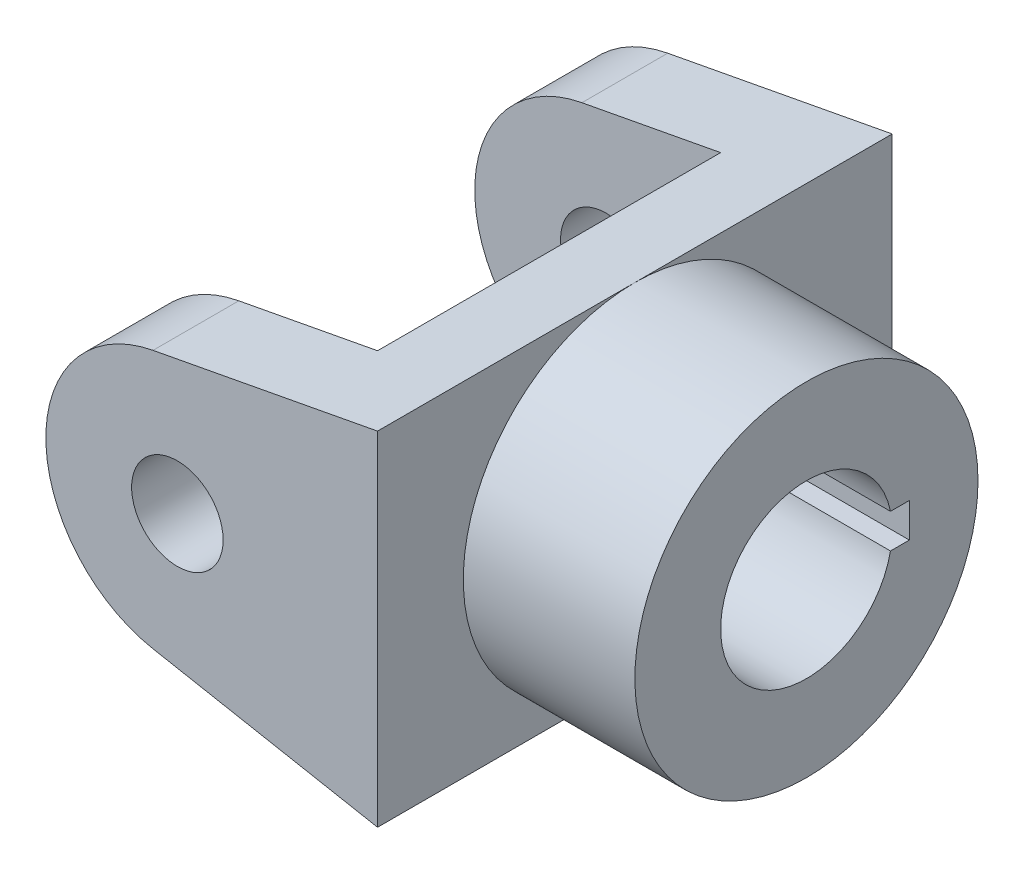
ISO-10303-21;
HEADER;
FILE_DESCRIPTION(('STEP AP214'),'2;1');
FILE_NAME('part.step','',(''),(''),'','','');
FILE_SCHEMA(('AUTOMOTIVE_DESIGN { 1 0 10303 214 1 1 1 1 }'));
ENDSEC;
DATA;
#1=APPLICATION_CONTEXT('core data for automotive mechanical design processes');
#2=APPLICATION_PROTOCOL_DEFINITION('international standard','automotive_design',2000,#1);
#3=PRODUCT_CONTEXT('',#1,'mechanical');
#4=PRODUCT('Part','Part','',(#3));
#5=PRODUCT_RELATED_PRODUCT_CATEGORY('part','',(#4));
#6=PRODUCT_DEFINITION_FORMATION('','',#4);
#7=PRODUCT_DEFINITION_CONTEXT('part definition',#1,'design');
#8=PRODUCT_DEFINITION('design','',#6,#7);
#9=PRODUCT_DEFINITION_SHAPE('','',#8);
#10=(LENGTH_UNIT() NAMED_UNIT(*) SI_UNIT(.MILLI.,.METRE.));
#11=(NAMED_UNIT(*) PLANE_ANGLE_UNIT() SI_UNIT($,.RADIAN.));
#12=(NAMED_UNIT(*) SI_UNIT($,.STERADIAN.) SOLID_ANGLE_UNIT());
#13=UNCERTAINTY_MEASURE_WITH_UNIT(LENGTH_MEASURE(1.E-05),#10,'distance_accuracy_value','');
#14=(GEOMETRIC_REPRESENTATION_CONTEXT(3) GLOBAL_UNCERTAINTY_ASSIGNED_CONTEXT((#13)) GLOBAL_UNIT_ASSIGNED_CONTEXT((#10,
#11,#12)) REPRESENTATION_CONTEXT('',''));
#15=CARTESIAN_POINT('',(0.,0.,0.));
#16=DIRECTION('',(0.,0.,1.));
#17=DIRECTION('',(1.,0.,0.));
#18=AXIS2_PLACEMENT_3D('',#15,#16,#17);
#19=CARTESIAN_POINT('',(14.,0.,45.));
#20=DIRECTION('',(-1.,0.,0.));
#21=DIRECTION('',(0.,0.,1.));
#22=AXIS2_PLACEMENT_3D('',#19,#20,#21);
#23=PLANE('',#22);
#24=CARTESIAN_POINT('',(14.,30.,0.));
#25=DIRECTION('',(1.,0.,0.));
#26=DIRECTION('',(0.,0.,-1.));
#27=AXIS2_PLACEMENT_3D('',#24,#25,#26);
#28=CIRCLE('',#27,30.);
#29=CARTESIAN_POINT('',(14.,60.,0.));
#30=VERTEX_POINT('',#29);
#31=CARTESIAN_POINT('',(14.,0.,0.));
#32=VERTEX_POINT('',#31);
#33=EDGE_CURVE('E83',#30,#32,#28,.T.);
#34=ORIENTED_EDGE('',*,*,#33,.F.);
#35=DIRECTION('',(0.,0.,1.));
#36=VECTOR('',#35,1.);
#37=CARTESIAN_POINT('',(14.,60.,45.));
#38=LINE('',#37,#36);
#39=CARTESIAN_POINT('',(14.,60.,45.));
#40=VERTEX_POINT('',#39);
#41=EDGE_CURVE('E305',#30,#40,#38,.T.);
#42=ORIENTED_EDGE('',*,*,#41,.T.);
#43=DIRECTION('',(0.,1.,0.));
#44=VECTOR('',#43,1.);
#45=CARTESIAN_POINT('',(14.,0.,45.));
#46=LINE('',#45,#44);
#47=CARTESIAN_POINT('',(14.,0.,45.));
#48=VERTEX_POINT('',#47);
#49=EDGE_CURVE('E306',#48,#40,#46,.T.);
#50=ORIENTED_EDGE('',*,*,#49,.F.);
#51=DIRECTION('',(0.,0.,1.));
#52=VECTOR('',#51,1.);
#53=CARTESIAN_POINT('',(14.,0.,45.));
#54=LINE('',#53,#52);
#55=EDGE_CURVE('E301',#32,#48,#54,.T.);
#56=ORIENTED_EDGE('',*,*,#55,.F.);
#57=EDGE_LOOP('',(#34,#42,#50,#56));
#58=FACE_BOUND('',#57,.T.);
#59=ADVANCED_FACE('F71',(#58),#23,.F.);
#60=CARTESIAN_POINT('',(-1.,0.,30.));
#61=DIRECTION('',(1.,0.,0.));
#62=DIRECTION('',(0.,0.,-1.));
#63=AXIS2_PLACEMENT_3D('',#60,#61,#62);
#64=PLANE('',#63);
#65=DIRECTION('',(0.,1.,0.));
#66=VECTOR('',#65,1.);
#67=CARTESIAN_POINT('',(-1.,0.,30.));
#68=LINE('',#67,#66);
#69=CARTESIAN_POINT('',(-1.,2.82652413038456,30.));
#70=VERTEX_POINT('',#69);
#71=CARTESIAN_POINT('',(-1.,57.1734758696154,30.));
#72=VERTEX_POINT('',#71);
#73=EDGE_CURVE('E295',#70,#72,#68,.T.);
#74=ORIENTED_EDGE('',*,*,#73,.T.);
#75=DIRECTION('',(0.,0.,-1.));
#76=VECTOR('',#75,1.);
#77=CARTESIAN_POINT('',(-1.,57.1734758696154,30.));
#78=LINE('',#77,#76);
#79=CARTESIAN_POINT('',(-1.00000000000001,57.1734758696154,-30.));
#80=VERTEX_POINT('',#79);
#81=EDGE_CURVE('E245',#72,#80,#78,.T.);
#82=ORIENTED_EDGE('',*,*,#81,.T.);
#83=DIRECTION('',(0.,1.,0.));
#84=VECTOR('',#83,1.);
#85=CARTESIAN_POINT('',(-1.00000000000001,0.,-30.));
#86=LINE('',#85,#84);
#87=CARTESIAN_POINT('',(-1.00000000000001,2.82652413038456,-30.));
#88=VERTEX_POINT('',#87);
#89=EDGE_CURVE('E313',#88,#80,#86,.T.);
#90=ORIENTED_EDGE('',*,*,#89,.F.);
#91=DIRECTION('',(0.,0.,-1.));
#92=VECTOR('',#91,1.);
#93=CARTESIAN_POINT('',(-1.,2.82652413038456,30.));
#94=LINE('',#93,#92);
#95=EDGE_CURVE('E280',#70,#88,#94,.T.);
#96=ORIENTED_EDGE('',*,*,#95,.F.);
#97=EDGE_LOOP('',(#74,#82,#90,#96));
#98=FACE_BOUND('',#97,.T.);
#99=DIRECTION('',(0.,0.,-1.));
#100=VECTOR('',#99,1.);
#101=CARTESIAN_POINT('',(-1.,33.,30.));
#102=LINE('',#101,#100);
#103=CARTESIAN_POINT('',(-1.00000000000001,33.,-14.6969384566991));
#104=VERTEX_POINT('',#103);
#105=CARTESIAN_POINT('',(-1.00000000000001,33.,-18.));
#106=VERTEX_POINT('',#105);
#107=EDGE_CURVE('E177',#104,#106,#102,.T.);
#108=ORIENTED_EDGE('',*,*,#107,.F.);
#109=CARTESIAN_POINT('',(-1.,30.,0.));
#110=DIRECTION('',(1.,0.,0.));
#111=DIRECTION('',(0.,0.,-1.));
#112=AXIS2_PLACEMENT_3D('',#109,#110,#111);
#113=CIRCLE('',#112,15.);
#114=CARTESIAN_POINT('',(-1.00000000000001,27.,-14.6969384566991));
#115=VERTEX_POINT('',#114);
#116=EDGE_CURVE('E181',#104,#115,#113,.T.);
#117=ORIENTED_EDGE('',*,*,#116,.T.);
#118=DIRECTION('',(0.,0.,-1.));
#119=VECTOR('',#118,1.);
#120=CARTESIAN_POINT('',(-1.,27.,30.));
#121=LINE('',#120,#119);
#122=CARTESIAN_POINT('',(-1.00000000000001,27.,-18.));
#123=VERTEX_POINT('',#122);
#124=EDGE_CURVE('E219',#115,#123,#121,.T.);
#125=ORIENTED_EDGE('',*,*,#124,.T.);
#126=DIRECTION('',(0.,-1.,0.));
#127=VECTOR('',#126,1.);
#128=CARTESIAN_POINT('',(-1.00000000000001,0.,-18.));
#129=LINE('',#128,#127);
#130=EDGE_CURVE('E223',#106,#123,#129,.T.);
#131=ORIENTED_EDGE('',*,*,#130,.F.);
#132=EDGE_LOOP('',(#108,#117,#125,#131));
#133=FACE_BOUND('',#132,.T.);
#134=ADVANCED_FACE('F334',(#98,#133),#64,.F.);
#135=EDGE_CURVE('E12',#32,#30,#28,.T.);
#136=ORIENTED_EDGE('',*,*,#135,.F.);
#137=CARTESIAN_POINT('',(14.,0.,-45.));
#138=VERTEX_POINT('',#137);
#139=EDGE_CURVE('E296',#138,#32,#54,.T.);
#140=ORIENTED_EDGE('',*,*,#139,.F.);
#141=DIRECTION('',(0.,1.,0.));
#142=VECTOR('',#141,1.);
#143=CARTESIAN_POINT('',(14.,0.,-45.));
#144=LINE('',#143,#142);
#145=CARTESIAN_POINT('',(14.,60.,-45.));
#146=VERTEX_POINT('',#145);
#147=EDGE_CURVE('E300',#138,#146,#144,.T.);
#148=ORIENTED_EDGE('',*,*,#147,.T.);
#149=EDGE_CURVE('E302',#146,#30,#38,.T.);
#150=ORIENTED_EDGE('',*,*,#149,.T.);
#151=EDGE_LOOP('',(#136,#140,#148,#150));
#152=FACE_BOUND('',#151,.T.);
#153=ADVANCED_FACE('F366',(#152),#23,.F.);
#154=CARTESIAN_POINT('',(-44.,60.,-45.));
#155=DIRECTION('',(0.,0.,1.));
#156=DIRECTION('',(1.,0.,0.));
#157=AXIS2_PLACEMENT_3D('',#154,#155,#156);
#158=PLANE('',#157);
#159=CARTESIAN_POINT('',(-21.,30.,-45.));
#160=DIRECTION('',(0.,0.,1.));
#161=DIRECTION('',(1.,0.,0.));
#162=AXIS2_PLACEMENT_3D('',#159,#160,#161);
#163=CIRCLE('',#162,8.);
#164=CARTESIAN_POINT('',(-13.,30.,-45.));
#165=VERTEX_POINT('',#164);
#166=EDGE_CURVE('E261',#165,#165,#163,.T.);
#167=ORIENTED_EDGE('',*,*,#166,.T.);
#168=EDGE_LOOP('',(#167));
#169=FACE_BOUND('',#168,.T.);
#170=CARTESIAN_POINT('',(-21.,30.,-45.));
#171=DIRECTION('',(0.,0.,1.));
#172=DIRECTION('',(1.,0.,0.));
#173=AXIS2_PLACEMENT_3D('',#170,#171,#172);
#174=CIRCLE('',#173,23.);
#175=CARTESIAN_POINT('',(-25.2590486637669,52.6022234410614,-45.));
#176=VERTEX_POINT('',#175);
#177=CARTESIAN_POINT('',(-25.2590486637669,7.3977765589386,-45.));
#178=VERTEX_POINT('',#177);
#179=EDGE_CURVE('E292',#176,#178,#174,.T.);
#180=ORIENTED_EDGE('',*,*,#179,.F.);
#181=DIRECTION('',(0.982705367002669,0.185176028859431,0.));
#182=VECTOR('',#181,1.);
#183=CARTESIAN_POINT('',(-42.0111706234794,49.4455383107766,-45.));
#184=LINE('',#183,#182);
#185=EDGE_CURVE('E253',#176,#146,#184,.T.);
#186=ORIENTED_EDGE('',*,*,#185,.T.);
#187=ORIENTED_EDGE('',*,*,#147,.F.);
#188=DIRECTION('',(0.982705367002669,-0.185176028859431,0.));
#189=VECTOR('',#188,1.);
#190=CARTESIAN_POINT('',(-52.9295792675036,12.6118713890724,-45.));
#191=LINE('',#190,#189);
#192=EDGE_CURVE('E286',#178,#138,#191,.T.);
#193=ORIENTED_EDGE('',*,*,#192,.F.);
#194=EDGE_LOOP('',(#180,#186,#187,#193));
#195=FACE_BOUND('',#194,.T.);
#196=ADVANCED_FACE('F73',(#169,#195),#158,.F.);
#197=CARTESIAN_POINT('',(-44.,60.,45.));
#198=DIRECTION('',(0.,0.,-1.));
#199=DIRECTION('',(-1.,0.,0.));
#200=AXIS2_PLACEMENT_3D('',#197,#198,#199);
#201=PLANE('',#200);
#202=CARTESIAN_POINT('',(-21.,30.,45.));
#203=DIRECTION('',(0.,0.,1.));
#204=DIRECTION('',(1.,0.,0.));
#205=AXIS2_PLACEMENT_3D('',#202,#203,#204);
#206=CIRCLE('',#205,8.);
#207=CARTESIAN_POINT('',(-13.,30.,45.));
#208=VERTEX_POINT('',#207);
#209=EDGE_CURVE('E228',#208,#208,#206,.T.);
#210=ORIENTED_EDGE('',*,*,#209,.F.);
#211=EDGE_LOOP('',(#210));
#212=FACE_BOUND('',#211,.T.);
#213=DIRECTION('',(0.982705367002669,0.185176028859431,0.));
#214=VECTOR('',#213,1.);
#215=CARTESIAN_POINT('',(-10.4383463807261,55.3949616165454,45.));
#216=LINE('',#215,#214);
#217=CARTESIAN_POINT('',(-25.2590486637669,52.6022234410614,45.));
#218=VERTEX_POINT('',#217);
#219=EDGE_CURVE('E232',#218,#40,#216,.T.);
#220=ORIENTED_EDGE('',*,*,#219,.F.);
#221=CARTESIAN_POINT('',(-21.,30.,45.));
#222=DIRECTION('',(0.,0.,1.));
#223=DIRECTION('',(1.,0.,0.));
#224=AXIS2_PLACEMENT_3D('',#221,#222,#223);
#225=CIRCLE('',#224,23.);
#226=CARTESIAN_POINT('',(-25.2590486637669,7.3977765589386,45.));
#227=VERTEX_POINT('',#226);
#228=EDGE_CURVE('E265',#218,#227,#225,.T.);
#229=ORIENTED_EDGE('',*,*,#228,.T.);
#230=DIRECTION('',(0.982705367002669,-0.185176028859431,0.));
#231=VECTOR('',#230,1.);
#232=CARTESIAN_POINT('',(0.480062263298083,2.54762868360565,45.));
#233=LINE('',#232,#231);
#234=EDGE_CURVE('E269',#227,#48,#233,.T.);
#235=ORIENTED_EDGE('',*,*,#234,.T.);
#236=ORIENTED_EDGE('',*,*,#49,.T.);
#237=EDGE_LOOP('',(#220,#229,#235,#236));
#238=FACE_BOUND('',#237,.T.);
#239=ADVANCED_FACE('F361',(#212,#238),#201,.F.);
#240=CARTESIAN_POINT('',(-1.00000000000001,0.,-30.));
#241=DIRECTION('',(0.,0.,-1.));
#242=DIRECTION('',(-1.,0.,0.));
#243=AXIS2_PLACEMENT_3D('',#240,#241,#242);
#244=PLANE('',#243);
#245=CARTESIAN_POINT('',(-21.,30.,-30.));
#246=DIRECTION('',(0.,0.,-1.));
#247=DIRECTION('',(-1.,0.,0.));
#248=AXIS2_PLACEMENT_3D('',#245,#246,#247);
#249=CIRCLE('',#248,8.);
#250=CARTESIAN_POINT('',(-29.,30.,-30.));
#251=VERTEX_POINT('',#250);
#252=EDGE_CURVE('E257',#251,#251,#249,.T.);
#253=ORIENTED_EDGE('',*,*,#252,.T.);
#254=EDGE_LOOP('',(#253));
#255=FACE_BOUND('',#254,.T.);
#256=DIRECTION('',(-0.982705367002669,-0.185176028859431,0.));
#257=VECTOR('',#256,1.);
#258=CARTESIAN_POINT('',(-11.404056219062,55.212988139145,-30.));
#259=LINE('',#258,#257);
#260=CARTESIAN_POINT('',(-25.2590486637669,52.6022234410614,-30.));
#261=VERTEX_POINT('',#260);
#262=EDGE_CURVE('E249',#80,#261,#259,.T.);
#263=ORIENTED_EDGE('',*,*,#262,.T.);
#264=CARTESIAN_POINT('',(-21.,30.,-30.));
#265=DIRECTION('',(0.,0.,-1.));
#266=DIRECTION('',(-1.,0.,0.));
#267=AXIS2_PLACEMENT_3D('',#264,#265,#266);
#268=CIRCLE('',#267,23.);
#269=CARTESIAN_POINT('',(-25.2590486637669,7.3977765589386,-30.));
#270=VERTEX_POINT('',#269);
#271=EDGE_CURVE('E289',#270,#261,#268,.T.);
#272=ORIENTED_EDGE('',*,*,#271,.F.);
#273=DIRECTION('',(-0.982705367002669,0.185176028859431,0.));
#274=VECTOR('',#273,1.);
#275=CARTESIAN_POINT('',(-0.485647575037776,2.72960216100606,-30.));
#276=LINE('',#275,#274);
#277=EDGE_CURVE('E283',#88,#270,#276,.T.);
#278=ORIENTED_EDGE('',*,*,#277,.F.);
#279=ORIENTED_EDGE('',*,*,#89,.T.);
#280=EDGE_LOOP('',(#263,#272,#278,#279));
#281=FACE_BOUND('',#280,.T.);
#282=ADVANCED_FACE('F342',(#255,#281),#244,.F.);
#283=CARTESIAN_POINT('',(-1.,0.,30.));
#284=DIRECTION('',(0.,0.,1.));
#285=DIRECTION('',(1.,0.,0.));
#286=AXIS2_PLACEMENT_3D('',#283,#284,#285);
#287=PLANE('',#286);
#288=CARTESIAN_POINT('',(-21.,30.,30.));
#289=DIRECTION('',(0.,0.,1.));
#290=DIRECTION('',(1.,0.,0.));
#291=AXIS2_PLACEMENT_3D('',#288,#289,#290);
#292=CIRCLE('',#291,8.);
#293=CARTESIAN_POINT('',(-13.,30.,30.));
#294=VERTEX_POINT('',#293);
#295=EDGE_CURVE('E75',#294,#294,#292,.T.);
#296=ORIENTED_EDGE('',*,*,#295,.T.);
#297=EDGE_LOOP('',(#296));
#298=FACE_BOUND('',#297,.T.);
#299=CARTESIAN_POINT('',(-21.,30.,30.));
#300=DIRECTION('',(0.,0.,1.));
#301=DIRECTION('',(1.,0.,0.));
#302=AXIS2_PLACEMENT_3D('',#299,#300,#301);
#303=CIRCLE('',#302,23.);
#304=CARTESIAN_POINT('',(-25.2590486637669,52.6022234410614,30.));
#305=VERTEX_POINT('',#304);
#306=CARTESIAN_POINT('',(-25.2590486637669,7.3977765589386,30.));
#307=VERTEX_POINT('',#306);
#308=EDGE_CURVE('E81',#305,#307,#303,.T.);
#309=ORIENTED_EDGE('',*,*,#308,.F.);
#310=DIRECTION('',(0.982705367002669,0.185176028859431,0.));
#311=VECTOR('',#310,1.);
#312=CARTESIAN_POINT('',(-11.404056219062,55.212988139145,30.));
#313=LINE('',#312,#311);
#314=EDGE_CURVE('E241',#305,#72,#313,.T.);
#315=ORIENTED_EDGE('',*,*,#314,.T.);
#316=ORIENTED_EDGE('',*,*,#73,.F.);
#317=DIRECTION('',(0.982705367002669,-0.185176028859431,0.));
#318=VECTOR('',#317,1.);
#319=CARTESIAN_POINT('',(-0.485647575037769,2.72960216100606,30.));
#320=LINE('',#319,#318);
#321=EDGE_CURVE('E277',#307,#70,#320,.T.);
#322=ORIENTED_EDGE('',*,*,#321,.F.);
#323=EDGE_LOOP('',(#309,#315,#316,#322));
#324=FACE_BOUND('',#323,.T.);
#325=ADVANCED_FACE('F332',(#298,#324),#287,.F.);
#326=CARTESIAN_POINT('',(-21.,30.,-80.));
#327=DIRECTION('',(0.,0.,1.));
#328=DIRECTION('',(1.,0.,0.));
#329=AXIS2_PLACEMENT_3D('',#326,#327,#328);
#330=CYLINDRICAL_SURFACE('',#329,23.);
#331=ORIENTED_EDGE('',*,*,#179,.T.);
#332=DIRECTION('',(0.,0.,1.));
#333=VECTOR('',#332,1.);
#334=CARTESIAN_POINT('',(-25.2590486637669,7.3977765589386,-80.));
#335=LINE('',#334,#333);
#336=EDGE_CURVE('E276',#178,#270,#335,.T.);
#337=ORIENTED_EDGE('',*,*,#336,.T.);
#338=ORIENTED_EDGE('',*,*,#271,.T.);
#339=DIRECTION('',(0.,0.,1.));
#340=VECTOR('',#339,1.);
#341=CARTESIAN_POINT('',(-25.2590486637669,52.6022234410614,-80.));
#342=LINE('',#341,#340);
#343=EDGE_CURVE('E240',#176,#261,#342,.T.);
#344=ORIENTED_EDGE('',*,*,#343,.F.);
#345=EDGE_LOOP('',(#331,#337,#338,#344));
#346=FACE_BOUND('',#345,.T.);
#347=ADVANCED_FACE('F346',(#346),#330,.T.);
#348=ORIENTED_EDGE('',*,*,#308,.T.);
#349=EDGE_CURVE('E273',#307,#227,#335,.T.);
#350=ORIENTED_EDGE('',*,*,#349,.T.);
#351=ORIENTED_EDGE('',*,*,#228,.F.);
#352=EDGE_CURVE('E236',#305,#218,#342,.T.);
#353=ORIENTED_EDGE('',*,*,#352,.F.);
#354=EDGE_LOOP('',(#348,#350,#351,#353));
#355=FACE_BOUND('',#354,.T.);
#356=ADVANCED_FACE('F323',(#355),#330,.T.);
#357=CARTESIAN_POINT('',(0.480062263298083,2.54762868360565,-80.));
#358=DIRECTION('',(-0.185176028859431,-0.982705367002669,0.));
#359=DIRECTION('',(0.982705367002669,-0.185176028859431,0.));
#360=AXIS2_PLACEMENT_3D('',#357,#358,#359);
#361=PLANE('',#360);
#362=ORIENTED_EDGE('',*,*,#192,.T.);
#363=ORIENTED_EDGE('',*,*,#139,.T.);
#364=ORIENTED_EDGE('',*,*,#55,.T.);
#365=ORIENTED_EDGE('',*,*,#234,.F.);
#366=ORIENTED_EDGE('',*,*,#349,.F.);
#367=ORIENTED_EDGE('',*,*,#321,.T.);
#368=ORIENTED_EDGE('',*,*,#95,.T.);
#369=ORIENTED_EDGE('',*,*,#277,.T.);
#370=ORIENTED_EDGE('',*,*,#336,.F.);
#371=EDGE_LOOP('',(#362,#363,#364,#365,#366,#367,#368,#369,#370));
#372=FACE_BOUND('',#371,.T.);
#373=ADVANCED_FACE('F329',(#372),#361,.T.);
#374=CARTESIAN_POINT('',(-10.4383463807261,55.3949616165454,-80.));
#375=DIRECTION('',(0.185176028859431,-0.982705367002669,0.));
#376=DIRECTION('',(0.982705367002669,0.185176028859431,0.));
#377=AXIS2_PLACEMENT_3D('',#374,#375,#376);
#378=PLANE('',#377);
#379=ORIENTED_EDGE('',*,*,#343,.T.);
#380=ORIENTED_EDGE('',*,*,#262,.F.);
#381=ORIENTED_EDGE('',*,*,#81,.F.);
#382=ORIENTED_EDGE('',*,*,#314,.F.);
#383=ORIENTED_EDGE('',*,*,#352,.T.);
#384=ORIENTED_EDGE('',*,*,#219,.T.);
#385=ORIENTED_EDGE('',*,*,#41,.F.);
#386=ORIENTED_EDGE('',*,*,#149,.F.);
#387=ORIENTED_EDGE('',*,*,#185,.F.);
#388=EDGE_LOOP('',(#379,#380,#381,#382,#383,#384,#385,#386,#387));
#389=FACE_BOUND('',#388,.T.);
#390=ADVANCED_FACE('F349',(#389),#378,.F.);
#391=CARTESIAN_POINT('',(-21.,30.,-80.));
#392=DIRECTION('',(0.,0.,1.));
#393=DIRECTION('',(1.,0.,0.));
#394=AXIS2_PLACEMENT_3D('',#391,#392,#393);
#395=CYLINDRICAL_SURFACE('',#394,8.);
#396=ORIENTED_EDGE('',*,*,#209,.T.);
#397=EDGE_LOOP('',(#396));
#398=FACE_BOUND('',#397,.T.);
#399=ORIENTED_EDGE('',*,*,#295,.F.);
#400=EDGE_LOOP('',(#399));
#401=FACE_BOUND('',#400,.T.);
#402=ADVANCED_FACE('F396',(#398,#401),#395,.F.);
#403=ORIENTED_EDGE('',*,*,#252,.F.);
#404=EDGE_LOOP('',(#403));
#405=FACE_BOUND('',#404,.T.);
#406=ORIENTED_EDGE('',*,*,#166,.F.);
#407=EDGE_LOOP('',(#406));
#408=FACE_BOUND('',#407,.T.);
#409=ADVANCED_FACE('F391',(#405,#408),#395,.F.);
#410=CARTESIAN_POINT('',(-16.,33.,0.));
#411=DIRECTION('',(0.,-1.,0.));
#412=DIRECTION('',(0.,0.,-1.));
#413=AXIS2_PLACEMENT_3D('',#410,#411,#412);
#414=PLANE('',#413);
#415=ORIENTED_EDGE('',*,*,#107,.T.);
#416=DIRECTION('',(1.,0.,0.));
#417=VECTOR('',#416,1.);
#418=CARTESIAN_POINT('',(-16.,33.,-18.));
#419=LINE('',#418,#417);
#420=CARTESIAN_POINT('',(44.,33.,-18.));
#421=VERTEX_POINT('',#420);
#422=EDGE_CURVE('E169',#106,#421,#419,.T.);
#423=ORIENTED_EDGE('',*,*,#422,.T.);
#424=DIRECTION('',(0.,0.,1.));
#425=VECTOR('',#424,1.);
#426=CARTESIAN_POINT('',(44.,33.,-14.6969384566991));
#427=LINE('',#426,#425);
#428=CARTESIAN_POINT('',(44.,33.,-14.6969384566991));
#429=VERTEX_POINT('',#428);
#430=EDGE_CURVE('E174',#421,#429,#427,.T.);
#431=ORIENTED_EDGE('',*,*,#430,.T.);
#432=DIRECTION('',(1.,0.,0.));
#433=VECTOR('',#432,1.);
#434=CARTESIAN_POINT('',(-16.,33.,-14.6969384566991));
#435=LINE('',#434,#433);
#436=EDGE_CURVE('E206',#104,#429,#435,.T.);
#437=ORIENTED_EDGE('',*,*,#436,.F.);
#438=EDGE_LOOP('',(#415,#423,#431,#437));
#439=FACE_BOUND('',#438,.T.);
#440=ADVANCED_FACE('F171',(#439),#414,.T.);
#441=CARTESIAN_POINT('',(-16.,0.,-18.));
#442=DIRECTION('',(0.,0.,1.));
#443=DIRECTION('',(1.,0.,0.));
#444=AXIS2_PLACEMENT_3D('',#441,#442,#443);
#445=PLANE('',#444);
#446=ORIENTED_EDGE('',*,*,#130,.T.);
#447=DIRECTION('',(1.,0.,0.));
#448=VECTOR('',#447,1.);
#449=CARTESIAN_POINT('',(-16.,27.,-18.));
#450=LINE('',#449,#448);
#451=CARTESIAN_POINT('',(44.,27.,-18.));
#452=VERTEX_POINT('',#451);
#453=EDGE_CURVE('E182',#123,#452,#450,.T.);
#454=ORIENTED_EDGE('',*,*,#453,.T.);
#455=DIRECTION('',(0.,1.,0.));
#456=VECTOR('',#455,1.);
#457=CARTESIAN_POINT('',(44.,33.,-18.));
#458=LINE('',#457,#456);
#459=EDGE_CURVE('E185',#452,#421,#458,.T.);
#460=ORIENTED_EDGE('',*,*,#459,.T.);
#461=ORIENTED_EDGE('',*,*,#422,.F.);
#462=EDGE_LOOP('',(#446,#454,#460,#461));
#463=FACE_BOUND('',#462,.T.);
#464=ADVANCED_FACE('F186',(#463),#445,.T.);
#465=CARTESIAN_POINT('',(-16.,27.,0.));
#466=DIRECTION('',(0.,-1.,0.));
#467=DIRECTION('',(0.,0.,-1.));
#468=AXIS2_PLACEMENT_3D('',#465,#466,#467);
#469=PLANE('',#468);
#470=DIRECTION('',(1.,0.,0.));
#471=VECTOR('',#470,1.);
#472=CARTESIAN_POINT('',(-16.,27.,-14.6969384566991));
#473=LINE('',#472,#471);
#474=CARTESIAN_POINT('',(44.,27.,-14.6969384566991));
#475=VERTEX_POINT('',#474);
#476=EDGE_CURVE('E96',#115,#475,#473,.T.);
#477=ORIENTED_EDGE('',*,*,#476,.T.);
#478=DIRECTION('',(0.,0.,-1.));
#479=VECTOR('',#478,1.);
#480=CARTESIAN_POINT('',(44.,27.,-14.6969384566991));
#481=LINE('',#480,#479);
#482=EDGE_CURVE('E198',#475,#452,#481,.T.);
#483=ORIENTED_EDGE('',*,*,#482,.T.);
#484=ORIENTED_EDGE('',*,*,#453,.F.);
#485=ORIENTED_EDGE('',*,*,#124,.F.);
#486=EDGE_LOOP('',(#477,#483,#484,#485));
#487=FACE_BOUND('',#486,.T.);
#488=ADVANCED_FACE('F478',(#487),#469,.F.);
#489=CARTESIAN_POINT('',(-16.,30.,0.));
#490=DIRECTION('',(1.,0.,0.));
#491=DIRECTION('',(0.,0.,-1.));
#492=AXIS2_PLACEMENT_3D('',#489,#490,#491);
#493=CYLINDRICAL_SURFACE('',#492,15.);
#494=ORIENTED_EDGE('',*,*,#436,.T.);
#495=CARTESIAN_POINT('',(44.,30.,0.));
#496=DIRECTION('',(1.,0.,0.));
#497=DIRECTION('',(0.,0.,-1.));
#498=AXIS2_PLACEMENT_3D('',#495,#496,#497);
#499=CIRCLE('',#498,15.);
#500=EDGE_CURVE('E194',#429,#475,#499,.T.);
#501=ORIENTED_EDGE('',*,*,#500,.T.);
#502=ORIENTED_EDGE('',*,*,#476,.F.);
#503=ORIENTED_EDGE('',*,*,#116,.F.);
#504=EDGE_LOOP('',(#494,#501,#502,#503));
#505=FACE_BOUND('',#504,.T.);
#506=ADVANCED_FACE('F475',(#505),#493,.F.);
#507=CARTESIAN_POINT('',(44.,30.,0.));
#508=DIRECTION('',(1.,0.,0.));
#509=DIRECTION('',(0.,0.,-1.));
#510=AXIS2_PLACEMENT_3D('',#507,#508,#509);
#511=PLANE('',#510);
#512=CARTESIAN_POINT('',(44.,30.,0.));
#513=DIRECTION('',(1.,0.,0.));
#514=DIRECTION('',(0.,0.,-1.));
#515=AXIS2_PLACEMENT_3D('',#512,#513,#514);
#516=CIRCLE('',#515,30.);
#517=CARTESIAN_POINT('',(44.,30.,-30.));
#518=VERTEX_POINT('',#517);
#519=EDGE_CURVE('E203',#518,#518,#516,.T.);
#520=ORIENTED_EDGE('',*,*,#519,.T.);
#521=EDGE_LOOP('',(#520));
#522=FACE_BOUND('',#521,.T.);
#523=ORIENTED_EDGE('',*,*,#430,.F.);
#524=ORIENTED_EDGE('',*,*,#459,.F.);
#525=ORIENTED_EDGE('',*,*,#482,.F.);
#526=ORIENTED_EDGE('',*,*,#500,.F.);
#527=EDGE_LOOP('',(#523,#524,#525,#526));
#528=FACE_BOUND('',#527,.T.);
#529=ADVANCED_FACE('F193',(#522,#528),#511,.T.);
#530=CARTESIAN_POINT('',(44.,30.,0.));
#531=DIRECTION('',(-1.,0.,0.));
#532=DIRECTION('',(0.,0.,1.));
#533=AXIS2_PLACEMENT_3D('',#530,#531,#532);
#534=CYLINDRICAL_SURFACE('',#533,30.);
#535=ORIENTED_EDGE('',*,*,#519,.F.);
#536=EDGE_LOOP('',(#535));
#537=FACE_BOUND('',#536,.T.);
#538=ORIENTED_EDGE('',*,*,#33,.T.);
#539=ORIENTED_EDGE('',*,*,#135,.T.);
#540=EDGE_LOOP('',(#538,#539));
#541=FACE_BOUND('',#540,.T.);
#542=ADVANCED_FACE('F484',(#537,#541),#534,.T.);
#543=CLOSED_SHELL('',(#59,#134,#153,#196,#239,#282,#325,#347,#356,#373,#390,#402,#409,#440,#464,
#488,#506,#529,#542));
#544=MANIFOLD_SOLID_BREP('B2',#543);
#545=ADVANCED_BREP_SHAPE_REPRESENTATION('',(#18,#544),#14);
#546=SHAPE_DEFINITION_REPRESENTATION(#9,#545);
ENDSEC;
END-ISO-10303-21;
